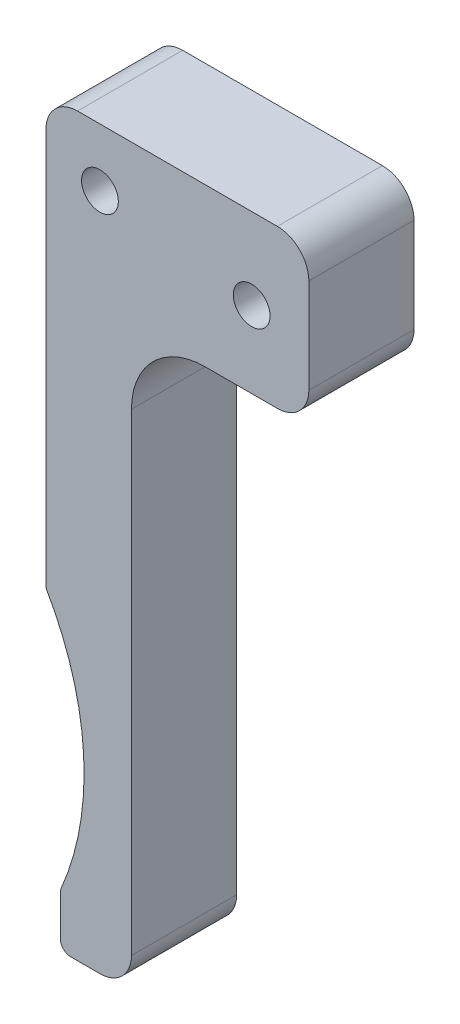
ISO-10303-21;
HEADER;
FILE_DESCRIPTION(('STEP AP214'),'2;1');
FILE_NAME('part.step','',(''),(''),'','','');
FILE_SCHEMA(('AUTOMOTIVE_DESIGN { 1 0 10303 214 1 1 1 1 }'));
ENDSEC;
DATA;
#1=APPLICATION_CONTEXT('core data for automotive mechanical design processes');
#2=APPLICATION_PROTOCOL_DEFINITION('international standard','automotive_design',2000,#1);
#3=PRODUCT_CONTEXT('',#1,'mechanical');
#4=PRODUCT('Part','Part','',(#3));
#5=PRODUCT_RELATED_PRODUCT_CATEGORY('part','',(#4));
#6=PRODUCT_DEFINITION_FORMATION('','',#4);
#7=PRODUCT_DEFINITION_CONTEXT('part definition',#1,'design');
#8=PRODUCT_DEFINITION('design','',#6,#7);
#9=PRODUCT_DEFINITION_SHAPE('','',#8);
#10=(LENGTH_UNIT() NAMED_UNIT(*) SI_UNIT(.MILLI.,.METRE.));
#11=(NAMED_UNIT(*) PLANE_ANGLE_UNIT() SI_UNIT($,.RADIAN.));
#12=(NAMED_UNIT(*) SI_UNIT($,.STERADIAN.) SOLID_ANGLE_UNIT());
#13=UNCERTAINTY_MEASURE_WITH_UNIT(LENGTH_MEASURE(1.E-05),#10,'distance_accuracy_value','');
#14=(GEOMETRIC_REPRESENTATION_CONTEXT(3) GLOBAL_UNCERTAINTY_ASSIGNED_CONTEXT((#13)) GLOBAL_UNIT_ASSIGNED_CONTEXT((#10,
#11,#12)) REPRESENTATION_CONTEXT('',''));
#15=CARTESIAN_POINT('',(0.,0.,0.));
#16=DIRECTION('',(0.,0.,1.));
#17=DIRECTION('',(1.,0.,0.));
#18=AXIS2_PLACEMENT_3D('',#15,#16,#17);
#19=CARTESIAN_POINT('',(66.4272158565531,48.4191783112097,10.));
#20=DIRECTION('',(0.,0.,-1.));
#21=DIRECTION('',(-1.,0.,0.));
#22=AXIS2_PLACEMENT_3D('',#19,#20,#21);
#23=PLANE('',#22);
#24=CARTESIAN_POINT('',(66.4272158565531,48.4191783112097,10.));
#25=DIRECTION('',(0.,0.,-1.));
#26=DIRECTION('',(-1.,0.,0.));
#27=AXIS2_PLACEMENT_3D('',#24,#25,#26);
#28=CIRCLE('',#27,26.7213810752987);
#29=CARTESIAN_POINT('',(89.5264843212709,61.8525696539133,10.));
#30=VERTEX_POINT('',#29);
#31=CARTESIAN_POINT('',(90.9652945599177,37.8401944224415,10.));
#32=VERTEX_POINT('',#31);
#33=EDGE_CURVE('E202',#30,#32,#28,.T.);
#34=ORIENTED_EDGE('',*,*,#33,.T.);
#35=CARTESIAN_POINT('',(91.8835883649504,37.4442948295665,10.));
#36=DIRECTION('',(0.,0.,1.));
#37=DIRECTION('',(-1.,0.,0.));
#38=AXIS2_PLACEMENT_3D('',#35,#36,#37);
#39=CIRCLE('',#38,1.);
#40=CARTESIAN_POINT('',(90.8835883649504,37.4442948295665,10.));
#41=VERTEX_POINT('',#40);
#42=EDGE_CURVE('E115',#32,#41,#39,.T.);
#43=ORIENTED_EDGE('',*,*,#42,.T.);
#44=DIRECTION('',(0.,-1.,0.));
#45=VECTOR('',#44,1.);
#46=CARTESIAN_POINT('',(90.8835883649504,33.6526537883267,10.));
#47=LINE('',#46,#45);
#48=CARTESIAN_POINT('',(90.8835883649504,33.6526537883267,10.));
#49=VERTEX_POINT('',#48);
#50=EDGE_CURVE('E238',#41,#49,#47,.T.);
#51=ORIENTED_EDGE('',*,*,#50,.T.);
#52=CARTESIAN_POINT('',(91.8835883649504,33.6526537883267,10.));
#53=DIRECTION('',(0.,0.,1.));
#54=DIRECTION('',(1.,0.,0.));
#55=AXIS2_PLACEMENT_3D('',#52,#53,#54);
#56=CIRCLE('',#55,1.);
#57=CARTESIAN_POINT('',(91.8835883649504,32.6526537883267,10.));
#58=VERTEX_POINT('',#57);
#59=EDGE_CURVE('E257',#49,#58,#56,.T.);
#60=ORIENTED_EDGE('',*,*,#59,.T.);
#61=DIRECTION('',(1.,0.,0.));
#62=VECTOR('',#61,1.);
#63=CARTESIAN_POINT('',(94.6557214692646,32.6526537883267,10.));
#64=LINE('',#63,#62);
#65=CARTESIAN_POINT('',(94.6557214692646,32.6526537883267,10.));
#66=VERTEX_POINT('',#65);
#67=EDGE_CURVE('E254',#58,#66,#64,.T.);
#68=ORIENTED_EDGE('',*,*,#67,.T.);
#69=CARTESIAN_POINT('',(94.6557214692646,35.6526537883267,10.));
#70=DIRECTION('',(0.,0.,1.));
#71=DIRECTION('',(-1.,0.,0.));
#72=AXIS2_PLACEMENT_3D('',#69,#70,#71);
#73=CIRCLE('',#72,3.);
#74=CARTESIAN_POINT('',(97.6557214692647,35.6526537883267,10.));
#75=VERTEX_POINT('',#74);
#76=EDGE_CURVE('E256',#66,#75,#73,.T.);
#77=ORIENTED_EDGE('',*,*,#76,.T.);
#78=DIRECTION('',(0.,1.,0.));
#79=VECTOR('',#78,1.);
#80=CARTESIAN_POINT('',(97.6557214692647,80.6526537883267,10.));
#81=LINE('',#80,#79);
#82=CARTESIAN_POINT('',(97.6557214692647,80.6526537883267,10.));
#83=VERTEX_POINT('',#82);
#84=EDGE_CURVE('E259',#75,#83,#81,.T.);
#85=ORIENTED_EDGE('',*,*,#84,.T.);
#86=CARTESIAN_POINT('',(104.655721469265,80.6526537883267,10.));
#87=DIRECTION('',(0.,0.,-1.));
#88=DIRECTION('',(-1.,0.,0.));
#89=AXIS2_PLACEMENT_3D('',#86,#87,#88);
#90=CIRCLE('',#89,7.00000000000001);
#91=CARTESIAN_POINT('',(104.655721469265,87.6526537883267,10.));
#92=VERTEX_POINT('',#91);
#93=EDGE_CURVE('E265',#83,#92,#90,.T.);
#94=ORIENTED_EDGE('',*,*,#93,.T.);
#95=DIRECTION('',(1.,0.,0.));
#96=VECTOR('',#95,1.);
#97=CARTESIAN_POINT('',(111.526484321271,87.6526537883267,10.));
#98=LINE('',#97,#96);
#99=CARTESIAN_POINT('',(111.526484321271,87.6526537883267,10.));
#100=VERTEX_POINT('',#99);
#101=EDGE_CURVE('E267',#92,#100,#98,.T.);
#102=ORIENTED_EDGE('',*,*,#101,.T.);
#103=CARTESIAN_POINT('',(111.526484321271,90.6526537883267,10.));
#104=DIRECTION('',(0.,0.,1.));
#105=DIRECTION('',(1.,0.,0.));
#106=AXIS2_PLACEMENT_3D('',#103,#104,#105);
#107=CIRCLE('',#106,3.);
#108=CARTESIAN_POINT('',(114.526484321271,90.6526537883267,10.));
#109=VERTEX_POINT('',#108);
#110=EDGE_CURVE('E269',#100,#109,#107,.T.);
#111=ORIENTED_EDGE('',*,*,#110,.T.);
#112=DIRECTION('',(0.,1.,0.));
#113=VECTOR('',#112,1.);
#114=CARTESIAN_POINT('',(114.526484321271,99.6526537883267,10.));
#115=LINE('',#114,#113);
#116=CARTESIAN_POINT('',(114.526484321271,99.6526537883267,10.));
#117=VERTEX_POINT('',#116);
#118=EDGE_CURVE('E271',#109,#117,#115,.T.);
#119=ORIENTED_EDGE('',*,*,#118,.T.);
#120=CARTESIAN_POINT('',(111.526484321271,99.6526537883267,10.));
#121=DIRECTION('',(0.,0.,1.));
#122=DIRECTION('',(1.,0.,0.));
#123=AXIS2_PLACEMENT_3D('',#120,#121,#122);
#124=CIRCLE('',#123,3.00000000000002);
#125=CARTESIAN_POINT('',(111.526484321271,102.652653788327,10.));
#126=VERTEX_POINT('',#125);
#127=EDGE_CURVE('E155',#117,#126,#124,.T.);
#128=ORIENTED_EDGE('',*,*,#127,.T.);
#129=DIRECTION('',(-1.,0.,0.));
#130=VECTOR('',#129,1.);
#131=CARTESIAN_POINT('',(92.5264843212709,102.652653788327,10.));
#132=LINE('',#131,#130);
#133=CARTESIAN_POINT('',(92.5264843212709,102.652653788327,10.));
#134=VERTEX_POINT('',#133);
#135=EDGE_CURVE('E149',#126,#134,#132,.T.);
#136=ORIENTED_EDGE('',*,*,#135,.T.);
#137=CARTESIAN_POINT('',(92.5264843212709,99.6526537883267,10.));
#138=DIRECTION('',(0.,0.,1.));
#139=DIRECTION('',(-1.,0.,0.));
#140=AXIS2_PLACEMENT_3D('',#137,#138,#139);
#141=CIRCLE('',#140,3.);
#142=CARTESIAN_POINT('',(89.5264843212709,99.6526537883267,10.));
#143=VERTEX_POINT('',#142);
#144=EDGE_CURVE('E153',#134,#143,#141,.T.);
#145=ORIENTED_EDGE('',*,*,#144,.T.);
#146=DIRECTION('',(0.,-1.,0.));
#147=VECTOR('',#146,1.);
#148=CARTESIAN_POINT('',(89.5264843212709,99.6526537883267,10.));
#149=LINE('',#148,#147);
#150=EDGE_CURVE('E51',#143,#30,#149,.T.);
#151=ORIENTED_EDGE('',*,*,#150,.T.);
#152=EDGE_LOOP('',(#34,#43,#51,#60,#68,#77,#85,#94,#102,#111,#119,#128,#136,#145,#151));
#153=FACE_BOUND('',#152,.T.);
#154=CARTESIAN_POINT('',(94.6557214692646,97.1315602564494,10.));
#155=DIRECTION('',(0.,0.,1.));
#156=DIRECTION('',(1.,0.,0.));
#157=AXIS2_PLACEMENT_3D('',#154,#155,#156);
#158=CIRCLE('',#157,1.75);
#159=CARTESIAN_POINT('',(96.4057214692646,97.1315602564494,10.));
#160=VERTEX_POINT('',#159);
#161=EDGE_CURVE('E177',#160,#160,#158,.T.);
#162=ORIENTED_EDGE('',*,*,#161,.F.);
#163=EDGE_LOOP('',(#162));
#164=FACE_BOUND('',#163,.T.);
#165=CARTESIAN_POINT('',(109.087030876175,94.9216596715155,10.));
#166=DIRECTION('',(0.,0.,1.));
#167=DIRECTION('',(1.,0.,0.));
#168=AXIS2_PLACEMENT_3D('',#165,#166,#167);
#169=CIRCLE('',#168,1.75);
#170=CARTESIAN_POINT('',(110.837030876175,94.9216596715155,10.));
#171=VERTEX_POINT('',#170);
#172=EDGE_CURVE('E312',#171,#171,#169,.T.);
#173=ORIENTED_EDGE('',*,*,#172,.F.);
#174=EDGE_LOOP('',(#173));
#175=FACE_BOUND('',#174,.T.);
#176=ADVANCED_FACE('F34',(#153,#164,#175),#23,.F.);
#177=CARTESIAN_POINT('',(66.4272158565531,48.4191783112097,0.));
#178=DIRECTION('',(0.,0.,-1.));
#179=DIRECTION('',(-1.,0.,0.));
#180=AXIS2_PLACEMENT_3D('',#177,#178,#179);
#181=PLANE('',#180);
#182=CARTESIAN_POINT('',(94.6557214692646,97.1315602564494,0.));
#183=DIRECTION('',(0.,0.,1.));
#184=DIRECTION('',(1.,0.,0.));
#185=AXIS2_PLACEMENT_3D('',#182,#183,#184);
#186=CIRCLE('',#185,1.75);
#187=CARTESIAN_POINT('',(96.4057214692646,97.1315602564494,0.));
#188=VERTEX_POINT('',#187);
#189=EDGE_CURVE('E317',#188,#188,#186,.T.);
#190=ORIENTED_EDGE('',*,*,#189,.T.);
#191=EDGE_LOOP('',(#190));
#192=FACE_BOUND('',#191,.T.);
#193=CARTESIAN_POINT('',(66.4272158565531,48.4191783112097,0.));
#194=DIRECTION('',(0.,0.,-1.));
#195=DIRECTION('',(-1.,0.,0.));
#196=AXIS2_PLACEMENT_3D('',#193,#194,#195);
#197=CIRCLE('',#196,26.7213810752987);
#198=CARTESIAN_POINT('',(89.5264843212709,61.8525696539133,0.));
#199=VERTEX_POINT('',#198);
#200=CARTESIAN_POINT('',(90.9652945599177,37.8401944224415,0.));
#201=VERTEX_POINT('',#200);
#202=EDGE_CURVE('E173',#199,#201,#197,.T.);
#203=ORIENTED_EDGE('',*,*,#202,.F.);
#204=DIRECTION('',(0.,-1.,0.));
#205=VECTOR('',#204,1.);
#206=CARTESIAN_POINT('',(89.5264843212709,99.6526537883267,0.));
#207=LINE('',#206,#205);
#208=CARTESIAN_POINT('',(89.5264843212709,99.6526537883267,0.));
#209=VERTEX_POINT('',#208);
#210=EDGE_CURVE('E107',#209,#199,#207,.T.);
#211=ORIENTED_EDGE('',*,*,#210,.F.);
#212=CARTESIAN_POINT('',(92.5264843212709,99.6526537883267,0.));
#213=DIRECTION('',(0.,0.,1.));
#214=DIRECTION('',(-1.,0.,0.));
#215=AXIS2_PLACEMENT_3D('',#212,#213,#214);
#216=CIRCLE('',#215,3.);
#217=CARTESIAN_POINT('',(92.5264843212709,102.652653788327,0.));
#218=VERTEX_POINT('',#217);
#219=EDGE_CURVE('E101',#218,#209,#216,.T.);
#220=ORIENTED_EDGE('',*,*,#219,.F.);
#221=DIRECTION('',(-1.,0.,0.));
#222=VECTOR('',#221,1.);
#223=CARTESIAN_POINT('',(92.5264843212709,102.652653788327,0.));
#224=LINE('',#223,#222);
#225=CARTESIAN_POINT('',(111.526484321271,102.652653788327,0.));
#226=VERTEX_POINT('',#225);
#227=EDGE_CURVE('E163',#226,#218,#224,.T.);
#228=ORIENTED_EDGE('',*,*,#227,.F.);
#229=CARTESIAN_POINT('',(111.526484321271,99.6526537883267,0.));
#230=DIRECTION('',(0.,0.,1.));
#231=DIRECTION('',(1.,0.,0.));
#232=AXIS2_PLACEMENT_3D('',#229,#230,#231);
#233=CIRCLE('',#232,3.00000000000002);
#234=CARTESIAN_POINT('',(114.526484321271,99.6526537883267,0.));
#235=VERTEX_POINT('',#234);
#236=EDGE_CURVE('E197',#235,#226,#233,.T.);
#237=ORIENTED_EDGE('',*,*,#236,.F.);
#238=DIRECTION('',(0.,1.,0.));
#239=VECTOR('',#238,1.);
#240=CARTESIAN_POINT('',(114.526484321271,99.6526537883267,0.));
#241=LINE('',#240,#239);
#242=CARTESIAN_POINT('',(114.526484321271,90.6526537883267,0.));
#243=VERTEX_POINT('',#242);
#244=EDGE_CURVE('E195',#243,#235,#241,.T.);
#245=ORIENTED_EDGE('',*,*,#244,.F.);
#246=CARTESIAN_POINT('',(111.526484321271,90.6526537883267,0.));
#247=DIRECTION('',(0.,0.,1.));
#248=DIRECTION('',(1.,0.,0.));
#249=AXIS2_PLACEMENT_3D('',#246,#247,#248);
#250=CIRCLE('',#249,3.);
#251=CARTESIAN_POINT('',(111.526484321271,87.6526537883267,0.));
#252=VERTEX_POINT('',#251);
#253=EDGE_CURVE('E193',#252,#243,#250,.T.);
#254=ORIENTED_EDGE('',*,*,#253,.F.);
#255=DIRECTION('',(1.,0.,0.));
#256=VECTOR('',#255,1.);
#257=CARTESIAN_POINT('',(111.526484321271,87.6526537883267,0.));
#258=LINE('',#257,#256);
#259=CARTESIAN_POINT('',(104.655721469265,87.6526537883267,0.));
#260=VERTEX_POINT('',#259);
#261=EDGE_CURVE('E191',#260,#252,#258,.T.);
#262=ORIENTED_EDGE('',*,*,#261,.F.);
#263=CARTESIAN_POINT('',(104.655721469265,80.6526537883267,0.));
#264=DIRECTION('',(0.,0.,-1.));
#265=DIRECTION('',(-1.,0.,0.));
#266=AXIS2_PLACEMENT_3D('',#263,#264,#265);
#267=CIRCLE('',#266,7.00000000000001);
#268=CARTESIAN_POINT('',(97.6557214692647,80.6526537883267,0.));
#269=VERTEX_POINT('',#268);
#270=EDGE_CURVE('E189',#269,#260,#267,.T.);
#271=ORIENTED_EDGE('',*,*,#270,.F.);
#272=DIRECTION('',(0.,1.,0.));
#273=VECTOR('',#272,1.);
#274=CARTESIAN_POINT('',(97.6557214692647,80.6526537883267,0.));
#275=LINE('',#274,#273);
#276=CARTESIAN_POINT('',(97.6557214692647,35.6526537883267,0.));
#277=VERTEX_POINT('',#276);
#278=EDGE_CURVE('E187',#277,#269,#275,.T.);
#279=ORIENTED_EDGE('',*,*,#278,.F.);
#280=CARTESIAN_POINT('',(94.6557214692646,35.6526537883267,0.));
#281=DIRECTION('',(0.,0.,1.));
#282=DIRECTION('',(-1.,0.,0.));
#283=AXIS2_PLACEMENT_3D('',#280,#281,#282);
#284=CIRCLE('',#283,3.);
#285=CARTESIAN_POINT('',(94.6557214692646,32.6526537883267,0.));
#286=VERTEX_POINT('',#285);
#287=EDGE_CURVE('E185',#286,#277,#284,.T.);
#288=ORIENTED_EDGE('',*,*,#287,.F.);
#289=DIRECTION('',(1.,0.,0.));
#290=VECTOR('',#289,1.);
#291=CARTESIAN_POINT('',(94.6557214692646,32.6526537883267,0.));
#292=LINE('',#291,#290);
#293=CARTESIAN_POINT('',(91.8835883649504,32.6526537883267,0.));
#294=VERTEX_POINT('',#293);
#295=EDGE_CURVE('E183',#294,#286,#292,.T.);
#296=ORIENTED_EDGE('',*,*,#295,.F.);
#297=CARTESIAN_POINT('',(91.8835883649504,33.6526537883267,0.));
#298=DIRECTION('',(0.,0.,1.));
#299=DIRECTION('',(1.,0.,0.));
#300=AXIS2_PLACEMENT_3D('',#297,#298,#299);
#301=CIRCLE('',#300,1.);
#302=CARTESIAN_POINT('',(90.8835883649504,33.6526537883267,0.));
#303=VERTEX_POINT('',#302);
#304=EDGE_CURVE('E181',#303,#294,#301,.T.);
#305=ORIENTED_EDGE('',*,*,#304,.F.);
#306=DIRECTION('',(0.,-1.,0.));
#307=VECTOR('',#306,1.);
#308=CARTESIAN_POINT('',(90.8835883649504,33.6526537883267,0.));
#309=LINE('',#308,#307);
#310=CARTESIAN_POINT('',(90.8835883649504,37.4442948295665,0.));
#311=VERTEX_POINT('',#310);
#312=EDGE_CURVE('E179',#311,#303,#309,.T.);
#313=ORIENTED_EDGE('',*,*,#312,.F.);
#314=CARTESIAN_POINT('',(91.8835883649504,37.4442948295665,0.));
#315=DIRECTION('',(0.,0.,1.));
#316=DIRECTION('',(-1.,0.,0.));
#317=AXIS2_PLACEMENT_3D('',#314,#315,#316);
#318=CIRCLE('',#317,1.);
#319=EDGE_CURVE('E176',#201,#311,#318,.T.);
#320=ORIENTED_EDGE('',*,*,#319,.F.);
#321=EDGE_LOOP('',(#203,#211,#220,#228,#237,#245,#254,#262,#271,#279,#288,#296,#305,#313,#320));
#322=FACE_BOUND('',#321,.T.);
#323=CARTESIAN_POINT('',(109.087030876175,94.9216596715155,0.));
#324=DIRECTION('',(0.,0.,1.));
#325=DIRECTION('',(1.,0.,0.));
#326=AXIS2_PLACEMENT_3D('',#323,#324,#325);
#327=CIRCLE('',#326,1.75);
#328=CARTESIAN_POINT('',(110.837030876175,94.9216596715155,0.));
#329=VERTEX_POINT('',#328);
#330=EDGE_CURVE('E315',#329,#329,#327,.T.);
#331=ORIENTED_EDGE('',*,*,#330,.T.);
#332=EDGE_LOOP('',(#331));
#333=FACE_BOUND('',#332,.T.);
#334=ADVANCED_FACE('F242',(#192,#322,#333),#181,.T.);
#335=CARTESIAN_POINT('',(66.4272158565531,48.4191783112097,10.));
#336=DIRECTION('',(0.,0.,-1.));
#337=DIRECTION('',(-1.,0.,0.));
#338=AXIS2_PLACEMENT_3D('',#335,#336,#337);
#339=CYLINDRICAL_SURFACE('',#338,26.7213810752987);
#340=ORIENTED_EDGE('',*,*,#202,.T.);
#341=DIRECTION('',(0.,0.,-1.));
#342=VECTOR('',#341,1.);
#343=CARTESIAN_POINT('',(90.9652945599177,37.8401944224415,10.));
#344=LINE('',#343,#342);
#345=EDGE_CURVE('E11',#32,#201,#344,.T.);
#346=ORIENTED_EDGE('',*,*,#345,.F.);
#347=ORIENTED_EDGE('',*,*,#33,.F.);
#348=DIRECTION('',(0.,0.,-1.));
#349=VECTOR('',#348,1.);
#350=CARTESIAN_POINT('',(89.5264843212709,61.8525696539133,10.));
#351=LINE('',#350,#349);
#352=EDGE_CURVE('E169',#30,#199,#351,.T.);
#353=ORIENTED_EDGE('',*,*,#352,.T.);
#354=EDGE_LOOP('',(#340,#346,#347,#353));
#355=FACE_BOUND('',#354,.T.);
#356=ADVANCED_FACE('F36',(#355),#339,.F.);
#357=CARTESIAN_POINT('',(91.8835883649504,37.4442948295665,10.));
#358=DIRECTION('',(0.,0.,-1.));
#359=DIRECTION('',(-1.,0.,0.));
#360=AXIS2_PLACEMENT_3D('',#357,#358,#359);
#361=CYLINDRICAL_SURFACE('',#360,1.);
#362=ORIENTED_EDGE('',*,*,#319,.T.);
#363=DIRECTION('',(0.,0.,-1.));
#364=VECTOR('',#363,1.);
#365=CARTESIAN_POINT('',(90.8835883649504,37.4442948295665,10.));
#366=LINE('',#365,#364);
#367=EDGE_CURVE('E43',#41,#311,#366,.T.);
#368=ORIENTED_EDGE('',*,*,#367,.F.);
#369=ORIENTED_EDGE('',*,*,#42,.F.);
#370=ORIENTED_EDGE('',*,*,#345,.T.);
#371=EDGE_LOOP('',(#362,#368,#369,#370));
#372=FACE_BOUND('',#371,.T.);
#373=ADVANCED_FACE('F442',(#372),#361,.T.);
#374=CARTESIAN_POINT('',(90.8835883649504,33.6526537883267,10.));
#375=DIRECTION('',(1.,0.,0.));
#376=DIRECTION('',(0.,0.,-1.));
#377=AXIS2_PLACEMENT_3D('',#374,#375,#376);
#378=PLANE('',#377);
#379=ORIENTED_EDGE('',*,*,#312,.T.);
#380=DIRECTION('',(0.,0.,-1.));
#381=VECTOR('',#380,1.);
#382=CARTESIAN_POINT('',(90.8835883649504,33.6526537883267,10.));
#383=LINE('',#382,#381);
#384=EDGE_CURVE('E230',#49,#303,#383,.T.);
#385=ORIENTED_EDGE('',*,*,#384,.F.);
#386=ORIENTED_EDGE('',*,*,#50,.F.);
#387=ORIENTED_EDGE('',*,*,#367,.T.);
#388=EDGE_LOOP('',(#379,#385,#386,#387));
#389=FACE_BOUND('',#388,.T.);
#390=ADVANCED_FACE('F236',(#389),#378,.F.);
#391=CARTESIAN_POINT('',(91.8835883649504,33.6526537883267,10.));
#392=DIRECTION('',(0.,0.,-1.));
#393=DIRECTION('',(-1.,0.,0.));
#394=AXIS2_PLACEMENT_3D('',#391,#392,#393);
#395=CYLINDRICAL_SURFACE('',#394,1.);
#396=ORIENTED_EDGE('',*,*,#304,.T.);
#397=DIRECTION('',(0.,0.,-1.));
#398=VECTOR('',#397,1.);
#399=CARTESIAN_POINT('',(91.8835883649504,32.6526537883267,10.));
#400=LINE('',#399,#398);
#401=EDGE_CURVE('E227',#58,#294,#400,.T.);
#402=ORIENTED_EDGE('',*,*,#401,.F.);
#403=ORIENTED_EDGE('',*,*,#59,.F.);
#404=ORIENTED_EDGE('',*,*,#384,.T.);
#405=EDGE_LOOP('',(#396,#402,#403,#404));
#406=FACE_BOUND('',#405,.T.);
#407=ADVANCED_FACE('F248',(#406),#395,.T.);
#408=CARTESIAN_POINT('',(94.6557214692646,32.6526537883267,10.));
#409=DIRECTION('',(0.,1.,0.));
#410=DIRECTION('',(-1.,0.,0.));
#411=AXIS2_PLACEMENT_3D('',#408,#409,#410);
#412=PLANE('',#411);
#413=ORIENTED_EDGE('',*,*,#295,.T.);
#414=DIRECTION('',(0.,0.,-1.));
#415=VECTOR('',#414,1.);
#416=CARTESIAN_POINT('',(94.6557214692646,32.6526537883267,10.));
#417=LINE('',#416,#415);
#418=EDGE_CURVE('E224',#66,#286,#417,.T.);
#419=ORIENTED_EDGE('',*,*,#418,.F.);
#420=ORIENTED_EDGE('',*,*,#67,.F.);
#421=ORIENTED_EDGE('',*,*,#401,.T.);
#422=EDGE_LOOP('',(#413,#419,#420,#421));
#423=FACE_BOUND('',#422,.T.);
#424=ADVANCED_FACE('F252',(#423),#412,.F.);
#425=CARTESIAN_POINT('',(94.6557214692646,35.6526537883267,10.));
#426=DIRECTION('',(0.,0.,-1.));
#427=DIRECTION('',(-1.,0.,0.));
#428=AXIS2_PLACEMENT_3D('',#425,#426,#427);
#429=CYLINDRICAL_SURFACE('',#428,3.);
#430=ORIENTED_EDGE('',*,*,#287,.T.);
#431=DIRECTION('',(0.,0.,-1.));
#432=VECTOR('',#431,1.);
#433=CARTESIAN_POINT('',(97.6557214692647,35.6526537883267,10.));
#434=LINE('',#433,#432);
#435=EDGE_CURVE('E221',#75,#277,#434,.T.);
#436=ORIENTED_EDGE('',*,*,#435,.F.);
#437=ORIENTED_EDGE('',*,*,#76,.F.);
#438=ORIENTED_EDGE('',*,*,#418,.T.);
#439=EDGE_LOOP('',(#430,#436,#437,#438));
#440=FACE_BOUND('',#439,.T.);
#441=ADVANCED_FACE('F407',(#440),#429,.T.);
#442=CARTESIAN_POINT('',(97.6557214692647,80.6526537883267,10.));
#443=DIRECTION('',(-1.,0.,0.));
#444=DIRECTION('',(0.,0.,1.));
#445=AXIS2_PLACEMENT_3D('',#442,#443,#444);
#446=PLANE('',#445);
#447=ORIENTED_EDGE('',*,*,#278,.T.);
#448=DIRECTION('',(0.,0.,-1.));
#449=VECTOR('',#448,1.);
#450=CARTESIAN_POINT('',(97.6557214692647,80.6526537883267,10.));
#451=LINE('',#450,#449);
#452=EDGE_CURVE('E218',#83,#269,#451,.T.);
#453=ORIENTED_EDGE('',*,*,#452,.F.);
#454=ORIENTED_EDGE('',*,*,#84,.F.);
#455=ORIENTED_EDGE('',*,*,#435,.T.);
#456=EDGE_LOOP('',(#447,#453,#454,#455));
#457=FACE_BOUND('',#456,.T.);
#458=ADVANCED_FACE('F397',(#457),#446,.F.);
#459=CARTESIAN_POINT('',(104.655721469265,80.6526537883267,10.));
#460=DIRECTION('',(0.,0.,-1.));
#461=DIRECTION('',(-1.,0.,0.));
#462=AXIS2_PLACEMENT_3D('',#459,#460,#461);
#463=CYLINDRICAL_SURFACE('',#462,7.00000000000001);
#464=ORIENTED_EDGE('',*,*,#270,.T.);
#465=DIRECTION('',(0.,0.,-1.));
#466=VECTOR('',#465,1.);
#467=CARTESIAN_POINT('',(104.655721469265,87.6526537883267,10.));
#468=LINE('',#467,#466);
#469=EDGE_CURVE('E215',#92,#260,#468,.T.);
#470=ORIENTED_EDGE('',*,*,#469,.F.);
#471=ORIENTED_EDGE('',*,*,#93,.F.);
#472=ORIENTED_EDGE('',*,*,#452,.T.);
#473=EDGE_LOOP('',(#464,#470,#471,#472));
#474=FACE_BOUND('',#473,.T.);
#475=ADVANCED_FACE('F387',(#474),#463,.F.);
#476=CARTESIAN_POINT('',(111.526484321271,87.6526537883267,10.));
#477=DIRECTION('',(0.,1.,0.));
#478=DIRECTION('',(0.,0.,1.));
#479=AXIS2_PLACEMENT_3D('',#476,#477,#478);
#480=PLANE('',#479);
#481=ORIENTED_EDGE('',*,*,#261,.T.);
#482=DIRECTION('',(0.,0.,-1.));
#483=VECTOR('',#482,1.);
#484=CARTESIAN_POINT('',(111.526484321271,87.6526537883267,10.));
#485=LINE('',#484,#483);
#486=EDGE_CURVE('E212',#100,#252,#485,.T.);
#487=ORIENTED_EDGE('',*,*,#486,.F.);
#488=ORIENTED_EDGE('',*,*,#101,.F.);
#489=ORIENTED_EDGE('',*,*,#469,.T.);
#490=EDGE_LOOP('',(#481,#487,#488,#489));
#491=FACE_BOUND('',#490,.T.);
#492=ADVANCED_FACE('F377',(#491),#480,.F.);
#493=CARTESIAN_POINT('',(111.526484321271,90.6526537883267,10.));
#494=DIRECTION('',(0.,0.,-1.));
#495=DIRECTION('',(-1.,0.,0.));
#496=AXIS2_PLACEMENT_3D('',#493,#494,#495);
#497=CYLINDRICAL_SURFACE('',#496,3.);
#498=ORIENTED_EDGE('',*,*,#253,.T.);
#499=DIRECTION('',(0.,0.,-1.));
#500=VECTOR('',#499,1.);
#501=CARTESIAN_POINT('',(114.526484321271,90.6526537883267,10.));
#502=LINE('',#501,#500);
#503=EDGE_CURVE('E209',#109,#243,#502,.T.);
#504=ORIENTED_EDGE('',*,*,#503,.F.);
#505=ORIENTED_EDGE('',*,*,#110,.F.);
#506=ORIENTED_EDGE('',*,*,#486,.T.);
#507=EDGE_LOOP('',(#498,#504,#505,#506));
#508=FACE_BOUND('',#507,.T.);
#509=ADVANCED_FACE('F368',(#508),#497,.T.);
#510=CARTESIAN_POINT('',(114.526484321271,99.6526537883267,10.));
#511=DIRECTION('',(-1.,0.,0.));
#512=DIRECTION('',(0.,-1.,0.));
#513=AXIS2_PLACEMENT_3D('',#510,#511,#512);
#514=PLANE('',#513);
#515=ORIENTED_EDGE('',*,*,#244,.T.);
#516=DIRECTION('',(0.,0.,-1.));
#517=VECTOR('',#516,1.);
#518=CARTESIAN_POINT('',(114.526484321271,99.6526537883267,10.));
#519=LINE('',#518,#517);
#520=EDGE_CURVE('E206',#117,#235,#519,.T.);
#521=ORIENTED_EDGE('',*,*,#520,.F.);
#522=ORIENTED_EDGE('',*,*,#118,.F.);
#523=ORIENTED_EDGE('',*,*,#503,.T.);
#524=EDGE_LOOP('',(#515,#521,#522,#523));
#525=FACE_BOUND('',#524,.T.);
#526=ADVANCED_FACE('F277',(#525),#514,.F.);
#527=CARTESIAN_POINT('',(111.526484321271,99.6526537883267,10.));
#528=DIRECTION('',(0.,0.,-1.));
#529=DIRECTION('',(-1.,0.,0.));
#530=AXIS2_PLACEMENT_3D('',#527,#528,#529);
#531=CYLINDRICAL_SURFACE('',#530,3.00000000000002);
#532=ORIENTED_EDGE('',*,*,#236,.T.);
#533=DIRECTION('',(0.,0.,-1.));
#534=VECTOR('',#533,1.);
#535=CARTESIAN_POINT('',(111.526484321271,102.652653788327,10.));
#536=LINE('',#535,#534);
#537=EDGE_CURVE('E164',#126,#226,#536,.T.);
#538=ORIENTED_EDGE('',*,*,#537,.F.);
#539=ORIENTED_EDGE('',*,*,#127,.F.);
#540=ORIENTED_EDGE('',*,*,#520,.T.);
#541=EDGE_LOOP('',(#532,#538,#539,#540));
#542=FACE_BOUND('',#541,.T.);
#543=ADVANCED_FACE('F281',(#542),#531,.T.);
#544=CARTESIAN_POINT('',(92.5264843212709,102.652653788327,10.));
#545=DIRECTION('',(0.,-1.,0.));
#546=DIRECTION('',(1.,0.,0.));
#547=AXIS2_PLACEMENT_3D('',#544,#545,#546);
#548=PLANE('',#547);
#549=ORIENTED_EDGE('',*,*,#227,.T.);
#550=DIRECTION('',(0.,0.,-1.));
#551=VECTOR('',#550,1.);
#552=CARTESIAN_POINT('',(92.5264843212709,102.652653788327,10.));
#553=LINE('',#552,#551);
#554=EDGE_CURVE('E160',#134,#218,#553,.T.);
#555=ORIENTED_EDGE('',*,*,#554,.F.);
#556=ORIENTED_EDGE('',*,*,#135,.F.);
#557=ORIENTED_EDGE('',*,*,#537,.T.);
#558=EDGE_LOOP('',(#549,#555,#556,#557));
#559=FACE_BOUND('',#558,.T.);
#560=ADVANCED_FACE('F161',(#559),#548,.F.);
#561=CARTESIAN_POINT('',(92.5264843212709,99.6526537883267,10.));
#562=DIRECTION('',(0.,0.,-1.));
#563=DIRECTION('',(-1.,0.,0.));
#564=AXIS2_PLACEMENT_3D('',#561,#562,#563);
#565=CYLINDRICAL_SURFACE('',#564,3.);
#566=ORIENTED_EDGE('',*,*,#219,.T.);
#567=DIRECTION('',(0.,0.,-1.));
#568=VECTOR('',#567,1.);
#569=CARTESIAN_POINT('',(89.5264843212709,99.6526537883267,10.));
#570=LINE('',#569,#568);
#571=EDGE_CURVE('E165',#143,#209,#570,.T.);
#572=ORIENTED_EDGE('',*,*,#571,.F.);
#573=ORIENTED_EDGE('',*,*,#144,.F.);
#574=ORIENTED_EDGE('',*,*,#554,.T.);
#575=EDGE_LOOP('',(#566,#572,#573,#574));
#576=FACE_BOUND('',#575,.T.);
#577=ADVANCED_FACE('F167',(#576),#565,.T.);
#578=CARTESIAN_POINT('',(89.5264843212709,99.6526537883267,10.));
#579=DIRECTION('',(1.,0.,0.));
#580=DIRECTION('',(0.,0.,-1.));
#581=AXIS2_PLACEMENT_3D('',#578,#579,#580);
#582=PLANE('',#581);
#583=ORIENTED_EDGE('',*,*,#210,.T.);
#584=ORIENTED_EDGE('',*,*,#352,.F.);
#585=ORIENTED_EDGE('',*,*,#150,.F.);
#586=ORIENTED_EDGE('',*,*,#571,.T.);
#587=EDGE_LOOP('',(#583,#584,#585,#586));
#588=FACE_BOUND('',#587,.T.);
#589=ADVANCED_FACE('F285',(#588),#582,.F.);
#590=CARTESIAN_POINT('',(94.6557214692646,97.1315602564494,10.));
#591=DIRECTION('',(0.,0.,-1.));
#592=DIRECTION('',(-1.,0.,0.));
#593=AXIS2_PLACEMENT_3D('',#590,#591,#592);
#594=CYLINDRICAL_SURFACE('',#593,1.75);
#595=ORIENTED_EDGE('',*,*,#161,.T.);
#596=EDGE_LOOP('',(#595));
#597=FACE_BOUND('',#596,.T.);
#598=ORIENTED_EDGE('',*,*,#189,.F.);
#599=EDGE_LOOP('',(#598));
#600=FACE_BOUND('',#599,.T.);
#601=ADVANCED_FACE('F287',(#597,#600),#594,.F.);
#602=CARTESIAN_POINT('',(109.087030876175,94.9216596715155,10.));
#603=DIRECTION('',(0.,0.,-1.));
#604=DIRECTION('',(-1.,0.,0.));
#605=AXIS2_PLACEMENT_3D('',#602,#603,#604);
#606=CYLINDRICAL_SURFACE('',#605,1.75);
#607=ORIENTED_EDGE('',*,*,#172,.T.);
#608=EDGE_LOOP('',(#607));
#609=FACE_BOUND('',#608,.T.);
#610=ORIENTED_EDGE('',*,*,#330,.F.);
#611=EDGE_LOOP('',(#610));
#612=FACE_BOUND('',#611,.T.);
#613=ADVANCED_FACE('F293',(#609,#612),#606,.F.);
#614=CLOSED_SHELL('',(#176,#334,#356,#373,#390,#407,#424,#441,#458,#475,#492,#509,#526,#543,
#560,#577,#589,#601,#613));
#615=MANIFOLD_SOLID_BREP('B2',#614);
#616=ADVANCED_BREP_SHAPE_REPRESENTATION('',(#18,#615),#14);
#617=SHAPE_DEFINITION_REPRESENTATION(#9,#616);
ENDSEC;
END-ISO-10303-21;
